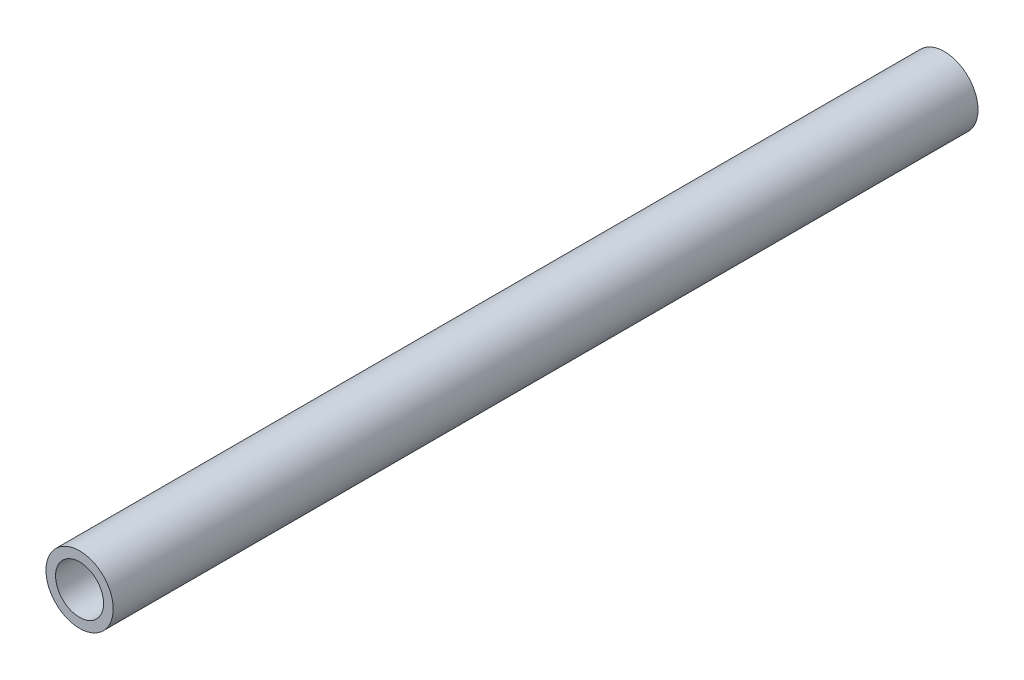
ISO-10303-21;
HEADER;
FILE_DESCRIPTION(('STEP AP214'),'2;1');
FILE_NAME('part.step','',(''),(''),'','','');
FILE_SCHEMA(('AUTOMOTIVE_DESIGN { 1 0 10303 214 1 1 1 1 }'));
ENDSEC;
DATA;
#1=APPLICATION_CONTEXT('core data for automotive mechanical design processes');
#2=APPLICATION_PROTOCOL_DEFINITION('international standard','automotive_design',2000,#1);
#3=PRODUCT_CONTEXT('',#1,'mechanical');
#4=PRODUCT('Part','Part','',(#3));
#5=PRODUCT_RELATED_PRODUCT_CATEGORY('part','',(#4));
#6=PRODUCT_DEFINITION_FORMATION('','',#4);
#7=PRODUCT_DEFINITION_CONTEXT('part definition',#1,'design');
#8=PRODUCT_DEFINITION('design','',#6,#7);
#9=PRODUCT_DEFINITION_SHAPE('','',#8);
#10=(LENGTH_UNIT() NAMED_UNIT(*) SI_UNIT(.MILLI.,.METRE.));
#11=(NAMED_UNIT(*) PLANE_ANGLE_UNIT() SI_UNIT($,.RADIAN.));
#12=(NAMED_UNIT(*) SI_UNIT($,.STERADIAN.) SOLID_ANGLE_UNIT());
#13=UNCERTAINTY_MEASURE_WITH_UNIT(LENGTH_MEASURE(1.E-05),#10,'distance_accuracy_value','');
#14=(GEOMETRIC_REPRESENTATION_CONTEXT(3) GLOBAL_UNCERTAINTY_ASSIGNED_CONTEXT((#13)) GLOBAL_UNIT_ASSIGNED_CONTEXT((#10,
#11,#12)) REPRESENTATION_CONTEXT('',''));
#15=CARTESIAN_POINT('',(0.,0.,0.));
#16=DIRECTION('',(0.,0.,1.));
#17=DIRECTION('',(1.,0.,0.));
#18=AXIS2_PLACEMENT_3D('',#15,#16,#17);
#19=CARTESIAN_POINT('',(0.,0.,90.));
#20=DIRECTION('',(0.,0.,1.));
#21=DIRECTION('',(1.,0.,0.));
#22=AXIS2_PLACEMENT_3D('',#19,#20,#21);
#23=PLANE('',#22);
#24=CARTESIAN_POINT('',(0.,0.,90.));
#25=DIRECTION('',(0.,0.,1.));
#26=DIRECTION('',(1.,0.,0.));
#27=AXIS2_PLACEMENT_3D('',#24,#25,#26);
#28=CIRCLE('',#27,3.5);
#29=CARTESIAN_POINT('',(3.5,0.,90.));
#30=VERTEX_POINT('',#29);
#31=EDGE_CURVE('E10',#30,#30,#28,.T.);
#32=ORIENTED_EDGE('',*,*,#31,.T.);
#33=EDGE_LOOP('',(#32));
#34=FACE_BOUND('',#33,.T.);
#35=CARTESIAN_POINT('',(0.,0.,90.));
#36=DIRECTION('',(0.,0.,1.));
#37=DIRECTION('',(1.,0.,0.));
#38=AXIS2_PLACEMENT_3D('',#35,#36,#37);
#39=CIRCLE('',#38,2.5);
#40=CARTESIAN_POINT('',(2.5,0.,90.));
#41=VERTEX_POINT('',#40);
#42=EDGE_CURVE('E44',#41,#41,#39,.T.);
#43=ORIENTED_EDGE('',*,*,#42,.F.);
#44=EDGE_LOOP('',(#43));
#45=FACE_BOUND('',#44,.T.);
#46=ADVANCED_FACE('F33',(#34,#45),#23,.T.);
#47=CARTESIAN_POINT('',(0.,0.,0.));
#48=DIRECTION('',(0.,0.,1.));
#49=DIRECTION('',(1.,0.,0.));
#50=AXIS2_PLACEMENT_3D('',#47,#48,#49);
#51=PLANE('',#50);
#52=CARTESIAN_POINT('',(0.,0.,0.));
#53=DIRECTION('',(0.,0.,1.));
#54=DIRECTION('',(1.,0.,0.));
#55=AXIS2_PLACEMENT_3D('',#52,#53,#54);
#56=CIRCLE('',#55,3.5);
#57=CARTESIAN_POINT('',(3.5,0.,0.));
#58=VERTEX_POINT('',#57);
#59=EDGE_CURVE('E37',#58,#58,#56,.T.);
#60=ORIENTED_EDGE('',*,*,#59,.F.);
#61=EDGE_LOOP('',(#60));
#62=FACE_BOUND('',#61,.T.);
#63=CARTESIAN_POINT('',(0.,0.,0.));
#64=DIRECTION('',(0.,0.,1.));
#65=DIRECTION('',(1.,0.,0.));
#66=AXIS2_PLACEMENT_3D('',#63,#64,#65);
#67=CIRCLE('',#66,2.5);
#68=CARTESIAN_POINT('',(2.5,0.,0.));
#69=VERTEX_POINT('',#68);
#70=EDGE_CURVE('E46',#69,#69,#67,.T.);
#71=ORIENTED_EDGE('',*,*,#70,.T.);
#72=EDGE_LOOP('',(#71));
#73=FACE_BOUND('',#72,.T.);
#74=ADVANCED_FACE('F56',(#62,#73),#51,.F.);
#75=CARTESIAN_POINT('',(0.,0.,90.));
#76=DIRECTION('',(0.,0.,-1.));
#77=DIRECTION('',(-1.,0.,0.));
#78=AXIS2_PLACEMENT_3D('',#75,#76,#77);
#79=CYLINDRICAL_SURFACE('',#78,3.5);
#80=ORIENTED_EDGE('',*,*,#31,.F.);
#81=EDGE_LOOP('',(#80));
#82=FACE_BOUND('',#81,.T.);
#83=ORIENTED_EDGE('',*,*,#59,.T.);
#84=EDGE_LOOP('',(#83));
#85=FACE_BOUND('',#84,.T.);
#86=ADVANCED_FACE('F35',(#82,#85),#79,.T.);
#87=CARTESIAN_POINT('',(0.,0.,90.));
#88=DIRECTION('',(0.,0.,-1.));
#89=DIRECTION('',(-1.,0.,0.));
#90=AXIS2_PLACEMENT_3D('',#87,#88,#89);
#91=CYLINDRICAL_SURFACE('',#90,2.5);
#92=ORIENTED_EDGE('',*,*,#42,.T.);
#93=EDGE_LOOP('',(#92));
#94=FACE_BOUND('',#93,.T.);
#95=ORIENTED_EDGE('',*,*,#70,.F.);
#96=EDGE_LOOP('',(#95));
#97=FACE_BOUND('',#96,.T.);
#98=ADVANCED_FACE('F52',(#94,#97),#91,.F.);
#99=CLOSED_SHELL('',(#46,#74,#86,#98));
#100=MANIFOLD_SOLID_BREP('B2',#99);
#101=ADVANCED_BREP_SHAPE_REPRESENTATION('',(#18,#100),#14);
#102=SHAPE_DEFINITION_REPRESENTATION(#9,#101);
ENDSEC;
END-ISO-10303-21;
